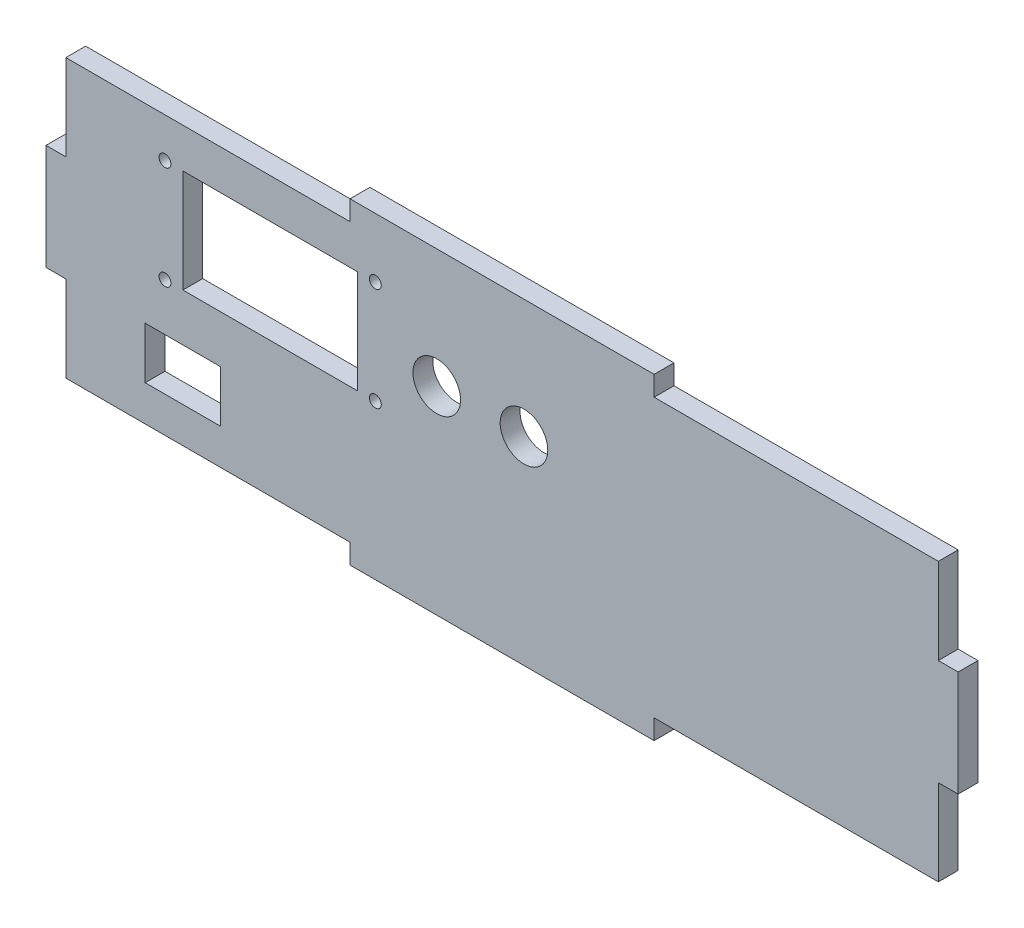
ISO-10303-21;
HEADER;
FILE_DESCRIPTION(('STEP AP214'),'2;1');
FILE_NAME('part.step','',(''),(''),'','','');
FILE_SCHEMA(('AUTOMOTIVE_DESIGN { 1 0 10303 214 1 1 1 1 }'));
ENDSEC;
DATA;
#1=APPLICATION_CONTEXT('core data for automotive mechanical design processes');
#2=APPLICATION_PROTOCOL_DEFINITION('international standard','automotive_design',2000,#1);
#3=PRODUCT_CONTEXT('',#1,'mechanical');
#4=PRODUCT('Part','Part','',(#3));
#5=PRODUCT_RELATED_PRODUCT_CATEGORY('part','',(#4));
#6=PRODUCT_DEFINITION_FORMATION('','',#4);
#7=PRODUCT_DEFINITION_CONTEXT('part definition',#1,'design');
#8=PRODUCT_DEFINITION('design','',#6,#7);
#9=PRODUCT_DEFINITION_SHAPE('','',#8);
#10=(LENGTH_UNIT() NAMED_UNIT(*) SI_UNIT(.MILLI.,.METRE.));
#11=(NAMED_UNIT(*) PLANE_ANGLE_UNIT() SI_UNIT($,.RADIAN.));
#12=(NAMED_UNIT(*) SI_UNIT($,.STERADIAN.) SOLID_ANGLE_UNIT());
#13=UNCERTAINTY_MEASURE_WITH_UNIT(LENGTH_MEASURE(1.E-05),#10,'distance_accuracy_value','');
#14=(GEOMETRIC_REPRESENTATION_CONTEXT(3) GLOBAL_UNCERTAINTY_ASSIGNED_CONTEXT((#13)) GLOBAL_UNIT_ASSIGNED_CONTEXT((#10,
#11,#12)) REPRESENTATION_CONTEXT('',''));
#15=CARTESIAN_POINT('',(0.,0.,0.));
#16=DIRECTION('',(0.,0.,1.));
#17=DIRECTION('',(1.,0.,0.));
#18=AXIS2_PLACEMENT_3D('',#15,#16,#17);
#19=CARTESIAN_POINT('',(0.,5.,5.));
#20=DIRECTION('',(0.,1.,0.));
#21=DIRECTION('',(0.,0.,1.));
#22=AXIS2_PLACEMENT_3D('',#19,#20,#21);
#23=PLANE('',#22);
#24=DIRECTION('',(1.,0.,0.));
#25=VECTOR('',#24,1.);
#26=CARTESIAN_POINT('',(0.,5.,0.));
#27=LINE('',#26,#25);
#28=CARTESIAN_POINT('',(5.,5.,0.));
#29=VERTEX_POINT('',#28);
#30=CARTESIAN_POINT('',(76.6666666666667,5.,0.));
#31=VERTEX_POINT('',#30);
#32=EDGE_CURVE('E342',#29,#31,#27,.T.);
#33=ORIENTED_EDGE('',*,*,#32,.T.);
#34=DIRECTION('',(0.,0.,-1.));
#35=VECTOR('',#34,1.);
#36=CARTESIAN_POINT('',(76.6666666666667,5.,5.));
#37=LINE('',#36,#35);
#38=CARTESIAN_POINT('',(76.6666666666667,5.,5.));
#39=VERTEX_POINT('',#38);
#40=EDGE_CURVE('E433',#39,#31,#37,.T.);
#41=ORIENTED_EDGE('',*,*,#40,.F.);
#42=DIRECTION('',(1.,0.,0.));
#43=VECTOR('',#42,1.);
#44=CARTESIAN_POINT('',(0.,5.,5.));
#45=LINE('',#44,#43);
#46=CARTESIAN_POINT('',(5.,5.,5.));
#47=VERTEX_POINT('',#46);
#48=EDGE_CURVE('E275',#47,#39,#45,.T.);
#49=ORIENTED_EDGE('',*,*,#48,.F.);
#50=DIRECTION('',(0.,0.,-1.));
#51=VECTOR('',#50,1.);
#52=CARTESIAN_POINT('',(5.,5.,5.));
#53=LINE('',#52,#51);
#54=EDGE_CURVE('E389',#47,#29,#53,.T.);
#55=ORIENTED_EDGE('',*,*,#54,.T.);
#56=EDGE_LOOP('',(#33,#41,#49,#55));
#57=FACE_BOUND('',#56,.T.);
#58=ADVANCED_FACE('F35',(#57),#23,.F.);
#59=CARTESIAN_POINT('',(76.6666666666667,0.,5.));
#60=DIRECTION('',(-1.,0.,0.));
#61=DIRECTION('',(0.,0.,1.));
#62=AXIS2_PLACEMENT_3D('',#59,#60,#61);
#63=PLANE('',#62);
#64=DIRECTION('',(0.,1.,0.));
#65=VECTOR('',#64,1.);
#66=CARTESIAN_POINT('',(76.6666666666667,0.,0.));
#67=LINE('',#66,#65);
#68=CARTESIAN_POINT('',(76.6666666666667,0.,0.));
#69=VERTEX_POINT('',#68);
#70=EDGE_CURVE('E345',#69,#31,#67,.T.);
#71=ORIENTED_EDGE('',*,*,#70,.F.);
#72=DIRECTION('',(0.,0.,-1.));
#73=VECTOR('',#72,1.);
#74=CARTESIAN_POINT('',(76.6666666666667,0.,5.));
#75=LINE('',#74,#73);
#76=CARTESIAN_POINT('',(76.6666666666667,0.,5.));
#77=VERTEX_POINT('',#76);
#78=EDGE_CURVE('E431',#77,#69,#75,.T.);
#79=ORIENTED_EDGE('',*,*,#78,.F.);
#80=DIRECTION('',(0.,1.,0.));
#81=VECTOR('',#80,1.);
#82=CARTESIAN_POINT('',(76.6666666666667,0.,5.));
#83=LINE('',#82,#81);
#84=EDGE_CURVE('E277',#77,#39,#83,.T.);
#85=ORIENTED_EDGE('',*,*,#84,.T.);
#86=ORIENTED_EDGE('',*,*,#40,.T.);
#87=EDGE_LOOP('',(#71,#79,#85,#86));
#88=FACE_BOUND('',#87,.T.);
#89=ADVANCED_FACE('F483',(#88),#63,.T.);
#90=CARTESIAN_POINT('',(0.,0.,5.));
#91=DIRECTION('',(0.,1.,0.));
#92=DIRECTION('',(0.,0.,1.));
#93=AXIS2_PLACEMENT_3D('',#90,#91,#92);
#94=PLANE('',#93);
#95=DIRECTION('',(1.,0.,0.));
#96=VECTOR('',#95,1.);
#97=CARTESIAN_POINT('',(0.,0.,0.));
#98=LINE('',#97,#96);
#99=CARTESIAN_POINT('',(153.333333333333,0.,0.));
#100=VERTEX_POINT('',#99);
#101=EDGE_CURVE('E349',#69,#100,#98,.T.);
#102=ORIENTED_EDGE('',*,*,#101,.T.);
#103=DIRECTION('',(0.,0.,-1.));
#104=VECTOR('',#103,1.);
#105=CARTESIAN_POINT('',(153.333333333333,0.,5.));
#106=LINE('',#105,#104);
#107=CARTESIAN_POINT('',(153.333333333333,0.,5.));
#108=VERTEX_POINT('',#107);
#109=EDGE_CURVE('E428',#108,#100,#106,.T.);
#110=ORIENTED_EDGE('',*,*,#109,.F.);
#111=DIRECTION('',(1.,0.,0.));
#112=VECTOR('',#111,1.);
#113=CARTESIAN_POINT('',(0.,0.,5.));
#114=LINE('',#113,#112);
#115=EDGE_CURVE('E281',#77,#108,#114,.T.);
#116=ORIENTED_EDGE('',*,*,#115,.F.);
#117=ORIENTED_EDGE('',*,*,#78,.T.);
#118=EDGE_LOOP('',(#102,#110,#116,#117));
#119=FACE_BOUND('',#118,.T.);
#120=ADVANCED_FACE('F490',(#119),#94,.F.);
#121=CARTESIAN_POINT('',(153.333333333333,0.,5.));
#122=DIRECTION('',(-1.,0.,0.));
#123=DIRECTION('',(0.,0.,1.));
#124=AXIS2_PLACEMENT_3D('',#121,#122,#123);
#125=PLANE('',#124);
#126=DIRECTION('',(0.,1.,0.));
#127=VECTOR('',#126,1.);
#128=CARTESIAN_POINT('',(153.333333333333,0.,0.));
#129=LINE('',#128,#127);
#130=CARTESIAN_POINT('',(153.333333333333,5.,0.));
#131=VERTEX_POINT('',#130);
#132=EDGE_CURVE('E351',#100,#131,#129,.T.);
#133=ORIENTED_EDGE('',*,*,#132,.T.);
#134=DIRECTION('',(0.,0.,-1.));
#135=VECTOR('',#134,1.);
#136=CARTESIAN_POINT('',(153.333333333333,5.,5.));
#137=LINE('',#136,#135);
#138=CARTESIAN_POINT('',(153.333333333333,5.,5.));
#139=VERTEX_POINT('',#138);
#140=EDGE_CURVE('E425',#139,#131,#137,.T.);
#141=ORIENTED_EDGE('',*,*,#140,.F.);
#142=DIRECTION('',(0.,1.,0.));
#143=VECTOR('',#142,1.);
#144=CARTESIAN_POINT('',(153.333333333333,0.,5.));
#145=LINE('',#144,#143);
#146=EDGE_CURVE('E283',#108,#139,#145,.T.);
#147=ORIENTED_EDGE('',*,*,#146,.F.);
#148=ORIENTED_EDGE('',*,*,#109,.T.);
#149=EDGE_LOOP('',(#133,#141,#147,#148));
#150=FACE_BOUND('',#149,.T.);
#151=ADVANCED_FACE('F497',(#150),#125,.F.);
#152=CARTESIAN_POINT('',(225.,5.,0.));
#153=VERTEX_POINT('',#152);
#154=EDGE_CURVE('E346',#131,#153,#27,.T.);
#155=ORIENTED_EDGE('',*,*,#154,.T.);
#156=DIRECTION('',(0.,0.,-1.));
#157=VECTOR('',#156,1.);
#158=CARTESIAN_POINT('',(225.,5.,5.));
#159=LINE('',#158,#157);
#160=CARTESIAN_POINT('',(225.,5.,5.));
#161=VERTEX_POINT('',#160);
#162=EDGE_CURVE('E422',#161,#153,#159,.T.);
#163=ORIENTED_EDGE('',*,*,#162,.F.);
#164=EDGE_CURVE('E278',#139,#161,#45,.T.);
#165=ORIENTED_EDGE('',*,*,#164,.F.);
#166=ORIENTED_EDGE('',*,*,#140,.T.);
#167=EDGE_LOOP('',(#155,#163,#165,#166));
#168=FACE_BOUND('',#167,.T.);
#169=ADVANCED_FACE('F486',(#168),#23,.F.);
#170=CARTESIAN_POINT('',(225.,0.,5.));
#171=DIRECTION('',(-1.,0.,0.));
#172=DIRECTION('',(0.,0.,1.));
#173=AXIS2_PLACEMENT_3D('',#170,#171,#172);
#174=PLANE('',#173);
#175=DIRECTION('',(0.,1.,0.));
#176=VECTOR('',#175,1.);
#177=CARTESIAN_POINT('',(225.,0.,0.));
#178=LINE('',#177,#176);
#179=CARTESIAN_POINT('',(225.,26.6666666666667,0.));
#180=VERTEX_POINT('',#179);
#181=EDGE_CURVE('E353',#153,#180,#178,.T.);
#182=ORIENTED_EDGE('',*,*,#181,.T.);
#183=DIRECTION('',(0.,0.,-1.));
#184=VECTOR('',#183,1.);
#185=CARTESIAN_POINT('',(225.,26.6666666666667,5.));
#186=LINE('',#185,#184);
#187=CARTESIAN_POINT('',(225.,26.6666666666667,5.));
#188=VERTEX_POINT('',#187);
#189=EDGE_CURVE('E420',#188,#180,#186,.T.);
#190=ORIENTED_EDGE('',*,*,#189,.F.);
#191=DIRECTION('',(0.,1.,0.));
#192=VECTOR('',#191,1.);
#193=CARTESIAN_POINT('',(225.,0.,5.));
#194=LINE('',#193,#192);
#195=EDGE_CURVE('E285',#161,#188,#194,.T.);
#196=ORIENTED_EDGE('',*,*,#195,.F.);
#197=ORIENTED_EDGE('',*,*,#162,.T.);
#198=EDGE_LOOP('',(#182,#190,#196,#197));
#199=FACE_BOUND('',#198,.T.);
#200=ADVANCED_FACE('F496',(#199),#174,.F.);
#201=CARTESIAN_POINT('',(0.,26.6666666666667,5.));
#202=DIRECTION('',(0.,-1.,0.));
#203=DIRECTION('',(0.,0.,-1.));
#204=AXIS2_PLACEMENT_3D('',#201,#202,#203);
#205=PLANE('',#204);
#206=DIRECTION('',(-1.,0.,0.));
#207=VECTOR('',#206,1.);
#208=CARTESIAN_POINT('',(0.,26.6666666666667,0.));
#209=LINE('',#208,#207);
#210=CARTESIAN_POINT('',(230.,26.6666666666667,0.));
#211=VERTEX_POINT('',#210);
#212=EDGE_CURVE('E356',#211,#180,#209,.T.);
#213=ORIENTED_EDGE('',*,*,#212,.F.);
#214=DIRECTION('',(0.,0.,-1.));
#215=VECTOR('',#214,1.);
#216=CARTESIAN_POINT('',(230.,26.6666666666667,5.));
#217=LINE('',#216,#215);
#218=CARTESIAN_POINT('',(230.,26.6666666666667,5.));
#219=VERTEX_POINT('',#218);
#220=EDGE_CURVE('E418',#219,#211,#217,.T.);
#221=ORIENTED_EDGE('',*,*,#220,.F.);
#222=DIRECTION('',(-1.,0.,0.));
#223=VECTOR('',#222,1.);
#224=CARTESIAN_POINT('',(0.,26.6666666666667,5.));
#225=LINE('',#224,#223);
#226=EDGE_CURVE('E287',#219,#188,#225,.T.);
#227=ORIENTED_EDGE('',*,*,#226,.T.);
#228=ORIENTED_EDGE('',*,*,#189,.T.);
#229=EDGE_LOOP('',(#213,#221,#227,#228));
#230=FACE_BOUND('',#229,.T.);
#231=ADVANCED_FACE('F503',(#230),#205,.T.);
#232=CARTESIAN_POINT('',(230.,0.,5.));
#233=DIRECTION('',(-1.,0.,0.));
#234=DIRECTION('',(0.,0.,1.));
#235=AXIS2_PLACEMENT_3D('',#232,#233,#234);
#236=PLANE('',#235);
#237=DIRECTION('',(0.,1.,0.));
#238=VECTOR('',#237,1.);
#239=CARTESIAN_POINT('',(230.,0.,0.));
#240=LINE('',#239,#238);
#241=CARTESIAN_POINT('',(230.,53.3333333333333,0.));
#242=VERTEX_POINT('',#241);
#243=EDGE_CURVE('E360',#211,#242,#240,.T.);
#244=ORIENTED_EDGE('',*,*,#243,.T.);
#245=DIRECTION('',(0.,0.,-1.));
#246=VECTOR('',#245,1.);
#247=CARTESIAN_POINT('',(230.,53.3333333333333,5.));
#248=LINE('',#247,#246);
#249=CARTESIAN_POINT('',(230.,53.3333333333333,5.));
#250=VERTEX_POINT('',#249);
#251=EDGE_CURVE('E415',#250,#242,#248,.T.);
#252=ORIENTED_EDGE('',*,*,#251,.F.);
#253=DIRECTION('',(0.,1.,0.));
#254=VECTOR('',#253,1.);
#255=CARTESIAN_POINT('',(230.,0.,5.));
#256=LINE('',#255,#254);
#257=EDGE_CURVE('E291',#219,#250,#256,.T.);
#258=ORIENTED_EDGE('',*,*,#257,.F.);
#259=ORIENTED_EDGE('',*,*,#220,.T.);
#260=EDGE_LOOP('',(#244,#252,#258,#259));
#261=FACE_BOUND('',#260,.T.);
#262=ADVANCED_FACE('F588',(#261),#236,.F.);
#263=CARTESIAN_POINT('',(0.,53.3333333333333,5.));
#264=DIRECTION('',(0.,-1.,0.));
#265=DIRECTION('',(0.,0.,-1.));
#266=AXIS2_PLACEMENT_3D('',#263,#264,#265);
#267=PLANE('',#266);
#268=DIRECTION('',(-1.,0.,0.));
#269=VECTOR('',#268,1.);
#270=CARTESIAN_POINT('',(0.,53.3333333333333,0.));
#271=LINE('',#270,#269);
#272=CARTESIAN_POINT('',(225.,53.3333333333333,0.));
#273=VERTEX_POINT('',#272);
#274=EDGE_CURVE('E362',#242,#273,#271,.T.);
#275=ORIENTED_EDGE('',*,*,#274,.T.);
#276=DIRECTION('',(0.,0.,-1.));
#277=VECTOR('',#276,1.);
#278=CARTESIAN_POINT('',(225.,53.3333333333333,5.));
#279=LINE('',#278,#277);
#280=CARTESIAN_POINT('',(225.,53.3333333333333,5.));
#281=VERTEX_POINT('',#280);
#282=EDGE_CURVE('E412',#281,#273,#279,.T.);
#283=ORIENTED_EDGE('',*,*,#282,.F.);
#284=DIRECTION('',(-1.,0.,0.));
#285=VECTOR('',#284,1.);
#286=CARTESIAN_POINT('',(0.,53.3333333333333,5.));
#287=LINE('',#286,#285);
#288=EDGE_CURVE('E293',#250,#281,#287,.T.);
#289=ORIENTED_EDGE('',*,*,#288,.F.);
#290=ORIENTED_EDGE('',*,*,#251,.T.);
#291=EDGE_LOOP('',(#275,#283,#289,#290));
#292=FACE_BOUND('',#291,.T.);
#293=ADVANCED_FACE('F586',(#292),#267,.F.);
#294=CARTESIAN_POINT('',(225.,75.,0.));
#295=VERTEX_POINT('',#294);
#296=EDGE_CURVE('E357',#273,#295,#178,.T.);
#297=ORIENTED_EDGE('',*,*,#296,.T.);
#298=DIRECTION('',(0.,0.,-1.));
#299=VECTOR('',#298,1.);
#300=CARTESIAN_POINT('',(225.,75.,5.));
#301=LINE('',#300,#299);
#302=CARTESIAN_POINT('',(225.,75.,5.));
#303=VERTEX_POINT('',#302);
#304=EDGE_CURVE('E410',#303,#295,#301,.T.);
#305=ORIENTED_EDGE('',*,*,#304,.F.);
#306=EDGE_CURVE('E288',#281,#303,#194,.T.);
#307=ORIENTED_EDGE('',*,*,#306,.F.);
#308=ORIENTED_EDGE('',*,*,#282,.T.);
#309=EDGE_LOOP('',(#297,#305,#307,#308));
#310=FACE_BOUND('',#309,.T.);
#311=ADVANCED_FACE('F506',(#310),#174,.F.);
#312=CARTESIAN_POINT('',(0.,75.,5.));
#313=DIRECTION('',(0.,1.,0.));
#314=DIRECTION('',(0.,0.,1.));
#315=AXIS2_PLACEMENT_3D('',#312,#313,#314);
#316=PLANE('',#315);
#317=DIRECTION('',(1.,0.,0.));
#318=VECTOR('',#317,1.);
#319=CARTESIAN_POINT('',(0.,75.,0.));
#320=LINE('',#319,#318);
#321=CARTESIAN_POINT('',(153.333333333333,75.,0.));
#322=VERTEX_POINT('',#321);
#323=EDGE_CURVE('E364',#322,#295,#320,.T.);
#324=ORIENTED_EDGE('',*,*,#323,.F.);
#325=DIRECTION('',(0.,0.,-1.));
#326=VECTOR('',#325,1.);
#327=CARTESIAN_POINT('',(153.333333333333,75.,5.));
#328=LINE('',#327,#326);
#329=CARTESIAN_POINT('',(153.333333333333,75.,5.));
#330=VERTEX_POINT('',#329);
#331=EDGE_CURVE('E408',#330,#322,#328,.T.);
#332=ORIENTED_EDGE('',*,*,#331,.F.);
#333=DIRECTION('',(1.,0.,0.));
#334=VECTOR('',#333,1.);
#335=CARTESIAN_POINT('',(0.,75.,5.));
#336=LINE('',#335,#334);
#337=EDGE_CURVE('E295',#330,#303,#336,.T.);
#338=ORIENTED_EDGE('',*,*,#337,.T.);
#339=ORIENTED_EDGE('',*,*,#304,.T.);
#340=EDGE_LOOP('',(#324,#332,#338,#339));
#341=FACE_BOUND('',#340,.T.);
#342=ADVANCED_FACE('F578',(#341),#316,.T.);
#343=CARTESIAN_POINT('',(153.333333333333,0.,5.));
#344=DIRECTION('',(1.,0.,0.));
#345=DIRECTION('',(0.,0.,-1.));
#346=AXIS2_PLACEMENT_3D('',#343,#344,#345);
#347=PLANE('',#346);
#348=DIRECTION('',(0.,-1.,0.));
#349=VECTOR('',#348,1.);
#350=CARTESIAN_POINT('',(153.333333333333,0.,0.));
#351=LINE('',#350,#349);
#352=CARTESIAN_POINT('',(153.333333333333,80.,0.));
#353=VERTEX_POINT('',#352);
#354=EDGE_CURVE('E367',#353,#322,#351,.T.);
#355=ORIENTED_EDGE('',*,*,#354,.F.);
#356=DIRECTION('',(0.,0.,-1.));
#357=VECTOR('',#356,1.);
#358=CARTESIAN_POINT('',(153.333333333333,80.,5.));
#359=LINE('',#358,#357);
#360=CARTESIAN_POINT('',(153.333333333333,80.,5.));
#361=VERTEX_POINT('',#360);
#362=EDGE_CURVE('E406',#361,#353,#359,.T.);
#363=ORIENTED_EDGE('',*,*,#362,.F.);
#364=DIRECTION('',(0.,-1.,0.));
#365=VECTOR('',#364,1.);
#366=CARTESIAN_POINT('',(153.333333333333,0.,5.));
#367=LINE('',#366,#365);
#368=EDGE_CURVE('E298',#361,#330,#367,.T.);
#369=ORIENTED_EDGE('',*,*,#368,.T.);
#370=ORIENTED_EDGE('',*,*,#331,.T.);
#371=EDGE_LOOP('',(#355,#363,#369,#370));
#372=FACE_BOUND('',#371,.T.);
#373=ADVANCED_FACE('F573',(#372),#347,.T.);
#374=CARTESIAN_POINT('',(0.,80.,5.));
#375=DIRECTION('',(0.,1.,0.));
#376=DIRECTION('',(0.,0.,1.));
#377=AXIS2_PLACEMENT_3D('',#374,#375,#376);
#378=PLANE('',#377);
#379=DIRECTION('',(1.,0.,0.));
#380=VECTOR('',#379,1.);
#381=CARTESIAN_POINT('',(0.,80.,0.));
#382=LINE('',#381,#380);
#383=CARTESIAN_POINT('',(76.6666666666667,80.,0.));
#384=VERTEX_POINT('',#383);
#385=EDGE_CURVE('E371',#384,#353,#382,.T.);
#386=ORIENTED_EDGE('',*,*,#385,.F.);
#387=DIRECTION('',(0.,0.,-1.));
#388=VECTOR('',#387,1.);
#389=CARTESIAN_POINT('',(76.6666666666667,80.,5.));
#390=LINE('',#389,#388);
#391=CARTESIAN_POINT('',(76.6666666666667,80.,5.));
#392=VERTEX_POINT('',#391);
#393=EDGE_CURVE('E404',#392,#384,#390,.T.);
#394=ORIENTED_EDGE('',*,*,#393,.F.);
#395=DIRECTION('',(1.,0.,0.));
#396=VECTOR('',#395,1.);
#397=CARTESIAN_POINT('',(0.,80.,5.));
#398=LINE('',#397,#396);
#399=EDGE_CURVE('E302',#392,#361,#398,.T.);
#400=ORIENTED_EDGE('',*,*,#399,.T.);
#401=ORIENTED_EDGE('',*,*,#362,.T.);
#402=EDGE_LOOP('',(#386,#394,#400,#401));
#403=FACE_BOUND('',#402,.T.);
#404=ADVANCED_FACE('F568',(#403),#378,.T.);
#405=CARTESIAN_POINT('',(76.6666666666667,0.,5.));
#406=DIRECTION('',(1.,0.,0.));
#407=DIRECTION('',(0.,0.,-1.));
#408=AXIS2_PLACEMENT_3D('',#405,#406,#407);
#409=PLANE('',#408);
#410=DIRECTION('',(0.,-1.,0.));
#411=VECTOR('',#410,1.);
#412=CARTESIAN_POINT('',(76.6666666666667,0.,0.));
#413=LINE('',#412,#411);
#414=CARTESIAN_POINT('',(76.6666666666667,75.,0.));
#415=VERTEX_POINT('',#414);
#416=EDGE_CURVE('E374',#384,#415,#413,.T.);
#417=ORIENTED_EDGE('',*,*,#416,.T.);
#418=DIRECTION('',(0.,0.,-1.));
#419=VECTOR('',#418,1.);
#420=CARTESIAN_POINT('',(76.6666666666667,75.,5.));
#421=LINE('',#420,#419);
#422=CARTESIAN_POINT('',(76.6666666666667,75.,5.));
#423=VERTEX_POINT('',#422);
#424=EDGE_CURVE('E402',#423,#415,#421,.T.);
#425=ORIENTED_EDGE('',*,*,#424,.F.);
#426=DIRECTION('',(0.,-1.,0.));
#427=VECTOR('',#426,1.);
#428=CARTESIAN_POINT('',(76.6666666666667,0.,5.));
#429=LINE('',#428,#427);
#430=EDGE_CURVE('E305',#392,#423,#429,.T.);
#431=ORIENTED_EDGE('',*,*,#430,.F.);
#432=ORIENTED_EDGE('',*,*,#393,.T.);
#433=EDGE_LOOP('',(#417,#425,#431,#432));
#434=FACE_BOUND('',#433,.T.);
#435=ADVANCED_FACE('F565',(#434),#409,.F.);
#436=CARTESIAN_POINT('',(5.,75.,0.));
#437=VERTEX_POINT('',#436);
#438=EDGE_CURVE('E368',#437,#415,#320,.T.);
#439=ORIENTED_EDGE('',*,*,#438,.F.);
#440=DIRECTION('',(0.,0.,-1.));
#441=VECTOR('',#440,1.);
#442=CARTESIAN_POINT('',(5.,75.,5.));
#443=LINE('',#442,#441);
#444=CARTESIAN_POINT('',(5.,75.,5.));
#445=VERTEX_POINT('',#444);
#446=EDGE_CURVE('E400',#445,#437,#443,.T.);
#447=ORIENTED_EDGE('',*,*,#446,.F.);
#448=EDGE_CURVE('E299',#445,#423,#336,.T.);
#449=ORIENTED_EDGE('',*,*,#448,.T.);
#450=ORIENTED_EDGE('',*,*,#424,.T.);
#451=EDGE_LOOP('',(#439,#447,#449,#450));
#452=FACE_BOUND('',#451,.T.);
#453=ADVANCED_FACE('F561',(#452),#316,.T.);
#454=CARTESIAN_POINT('',(5.,0.,5.));
#455=DIRECTION('',(-1.,0.,0.));
#456=DIRECTION('',(0.,-1.,0.));
#457=AXIS2_PLACEMENT_3D('',#454,#455,#456);
#458=PLANE('',#457);
#459=DIRECTION('',(0.,1.,0.));
#460=VECTOR('',#459,1.);
#461=CARTESIAN_POINT('',(5.,0.,0.));
#462=LINE('',#461,#460);
#463=CARTESIAN_POINT('',(5.,53.3333333333333,0.));
#464=VERTEX_POINT('',#463);
#465=EDGE_CURVE('E377',#464,#437,#462,.T.);
#466=ORIENTED_EDGE('',*,*,#465,.F.);
#467=DIRECTION('',(0.,0.,-1.));
#468=VECTOR('',#467,1.);
#469=CARTESIAN_POINT('',(5.,53.3333333333333,5.));
#470=LINE('',#469,#468);
#471=CARTESIAN_POINT('',(5.,53.3333333333333,5.));
#472=VERTEX_POINT('',#471);
#473=EDGE_CURVE('E398',#472,#464,#470,.T.);
#474=ORIENTED_EDGE('',*,*,#473,.F.);
#475=DIRECTION('',(0.,1.,0.));
#476=VECTOR('',#475,1.);
#477=CARTESIAN_POINT('',(5.,0.,5.));
#478=LINE('',#477,#476);
#479=EDGE_CURVE('E307',#472,#445,#478,.T.);
#480=ORIENTED_EDGE('',*,*,#479,.T.);
#481=ORIENTED_EDGE('',*,*,#446,.T.);
#482=EDGE_LOOP('',(#466,#474,#480,#481));
#483=FACE_BOUND('',#482,.T.);
#484=ADVANCED_FACE('F480',(#483),#458,.T.);
#485=CARTESIAN_POINT('',(0.,53.3333333333333,5.));
#486=DIRECTION('',(0.,1.,0.));
#487=DIRECTION('',(0.,0.,1.));
#488=AXIS2_PLACEMENT_3D('',#485,#486,#487);
#489=PLANE('',#488);
#490=DIRECTION('',(1.,0.,0.));
#491=VECTOR('',#490,1.);
#492=CARTESIAN_POINT('',(0.,53.3333333333333,0.));
#493=LINE('',#492,#491);
#494=CARTESIAN_POINT('',(0.,53.3333333333333,0.));
#495=VERTEX_POINT('',#494);
#496=EDGE_CURVE('E380',#495,#464,#493,.T.);
#497=ORIENTED_EDGE('',*,*,#496,.F.);
#498=DIRECTION('',(0.,0.,-1.));
#499=VECTOR('',#498,1.);
#500=CARTESIAN_POINT('',(0.,53.3333333333333,5.));
#501=LINE('',#500,#499);
#502=CARTESIAN_POINT('',(0.,53.3333333333333,5.));
#503=VERTEX_POINT('',#502);
#504=EDGE_CURVE('E396',#503,#495,#501,.T.);
#505=ORIENTED_EDGE('',*,*,#504,.F.);
#506=DIRECTION('',(1.,0.,0.));
#507=VECTOR('',#506,1.);
#508=CARTESIAN_POINT('',(0.,53.3333333333333,5.));
#509=LINE('',#508,#507);
#510=EDGE_CURVE('E310',#503,#472,#509,.T.);
#511=ORIENTED_EDGE('',*,*,#510,.T.);
#512=ORIENTED_EDGE('',*,*,#473,.T.);
#513=EDGE_LOOP('',(#497,#505,#511,#512));
#514=FACE_BOUND('',#513,.T.);
#515=ADVANCED_FACE('F551',(#514),#489,.T.);
#516=CARTESIAN_POINT('',(0.,0.,5.));
#517=DIRECTION('',(-1.,0.,0.));
#518=DIRECTION('',(0.,0.,1.));
#519=AXIS2_PLACEMENT_3D('',#516,#517,#518);
#520=PLANE('',#519);
#521=DIRECTION('',(0.,1.,0.));
#522=VECTOR('',#521,1.);
#523=CARTESIAN_POINT('',(0.,0.,0.));
#524=LINE('',#523,#522);
#525=CARTESIAN_POINT('',(0.,26.6666666666667,0.));
#526=VERTEX_POINT('',#525);
#527=EDGE_CURVE('E383',#526,#495,#524,.T.);
#528=ORIENTED_EDGE('',*,*,#527,.F.);
#529=DIRECTION('',(0.,0.,-1.));
#530=VECTOR('',#529,1.);
#531=CARTESIAN_POINT('',(0.,26.6666666666667,5.));
#532=LINE('',#531,#530);
#533=CARTESIAN_POINT('',(0.,26.6666666666667,5.));
#534=VERTEX_POINT('',#533);
#535=EDGE_CURVE('E394',#534,#526,#532,.T.);
#536=ORIENTED_EDGE('',*,*,#535,.F.);
#537=DIRECTION('',(0.,1.,0.));
#538=VECTOR('',#537,1.);
#539=CARTESIAN_POINT('',(0.,0.,5.));
#540=LINE('',#539,#538);
#541=EDGE_CURVE('E314',#534,#503,#540,.T.);
#542=ORIENTED_EDGE('',*,*,#541,.T.);
#543=ORIENTED_EDGE('',*,*,#504,.T.);
#544=EDGE_LOOP('',(#528,#536,#542,#543));
#545=FACE_BOUND('',#544,.T.);
#546=ADVANCED_FACE('F546',(#545),#520,.T.);
#547=CARTESIAN_POINT('',(0.,26.6666666666667,5.));
#548=DIRECTION('',(0.,1.,0.));
#549=DIRECTION('',(0.,0.,1.));
#550=AXIS2_PLACEMENT_3D('',#547,#548,#549);
#551=PLANE('',#550);
#552=DIRECTION('',(1.,0.,0.));
#553=VECTOR('',#552,1.);
#554=CARTESIAN_POINT('',(0.,26.6666666666667,0.));
#555=LINE('',#554,#553);
#556=CARTESIAN_POINT('',(5.,26.6666666666667,0.));
#557=VERTEX_POINT('',#556);
#558=EDGE_CURVE('E386',#526,#557,#555,.T.);
#559=ORIENTED_EDGE('',*,*,#558,.T.);
#560=DIRECTION('',(0.,0.,-1.));
#561=VECTOR('',#560,1.);
#562=CARTESIAN_POINT('',(5.,26.6666666666667,5.));
#563=LINE('',#562,#561);
#564=CARTESIAN_POINT('',(5.,26.6666666666667,5.));
#565=VERTEX_POINT('',#564);
#566=EDGE_CURVE('E391',#565,#557,#563,.T.);
#567=ORIENTED_EDGE('',*,*,#566,.F.);
#568=DIRECTION('',(1.,0.,0.));
#569=VECTOR('',#568,1.);
#570=CARTESIAN_POINT('',(0.,26.6666666666667,5.));
#571=LINE('',#570,#569);
#572=EDGE_CURVE('E317',#534,#565,#571,.T.);
#573=ORIENTED_EDGE('',*,*,#572,.F.);
#574=ORIENTED_EDGE('',*,*,#535,.T.);
#575=EDGE_LOOP('',(#559,#567,#573,#574));
#576=FACE_BOUND('',#575,.T.);
#577=ADVANCED_FACE('F543',(#576),#551,.F.);
#578=CARTESIAN_POINT('',(0.,65.,5.));
#579=DIRECTION('',(0.,1.,0.));
#580=DIRECTION('',(0.,0.,1.));
#581=AXIS2_PLACEMENT_3D('',#578,#579,#580);
#582=PLANE('',#581);
#583=DIRECTION('',(1.,0.,0.));
#584=VECTOR('',#583,1.);
#585=CARTESIAN_POINT('',(0.,65.,0.));
#586=LINE('',#585,#584);
#587=CARTESIAN_POINT('',(34.52,65.,0.));
#588=VERTEX_POINT('',#587);
#589=CARTESIAN_POINT('',(78.52,65.,0.));
#590=VERTEX_POINT('',#589);
#591=EDGE_CURVE('E330',#588,#590,#586,.T.);
#592=ORIENTED_EDGE('',*,*,#591,.T.);
#593=DIRECTION('',(0.,0.,-1.));
#594=VECTOR('',#593,1.);
#595=CARTESIAN_POINT('',(78.52,65.,5.));
#596=LINE('',#595,#594);
#597=CARTESIAN_POINT('',(78.52,65.,5.));
#598=VERTEX_POINT('',#597);
#599=EDGE_CURVE('E392',#598,#590,#596,.T.);
#600=ORIENTED_EDGE('',*,*,#599,.F.);
#601=DIRECTION('',(1.,0.,0.));
#602=VECTOR('',#601,1.);
#603=CARTESIAN_POINT('',(0.,65.,5.));
#604=LINE('',#603,#602);
#605=CARTESIAN_POINT('',(34.52,65.,5.));
#606=VERTEX_POINT('',#605);
#607=EDGE_CURVE('E264',#606,#598,#604,.T.);
#608=ORIENTED_EDGE('',*,*,#607,.F.);
#609=DIRECTION('',(0.,0.,-1.));
#610=VECTOR('',#609,1.);
#611=CARTESIAN_POINT('',(34.52,65.,5.));
#612=LINE('',#611,#610);
#613=EDGE_CURVE('E436',#606,#588,#612,.T.);
#614=ORIENTED_EDGE('',*,*,#613,.T.);
#615=EDGE_LOOP('',(#592,#600,#608,#614));
#616=FACE_BOUND('',#615,.T.);
#617=ADVANCED_FACE('F611',(#616),#582,.F.);
#618=CARTESIAN_POINT('',(78.52,0.,5.));
#619=DIRECTION('',(1.,0.,0.));
#620=DIRECTION('',(0.,0.,-1.));
#621=AXIS2_PLACEMENT_3D('',#618,#619,#620);
#622=PLANE('',#621);
#623=DIRECTION('',(0.,-1.,0.));
#624=VECTOR('',#623,1.);
#625=CARTESIAN_POINT('',(78.52,0.,0.));
#626=LINE('',#625,#624);
#627=CARTESIAN_POINT('',(78.52,39.,0.));
#628=VERTEX_POINT('',#627);
#629=EDGE_CURVE('E333',#590,#628,#626,.T.);
#630=ORIENTED_EDGE('',*,*,#629,.T.);
#631=DIRECTION('',(0.,0.,-1.));
#632=VECTOR('',#631,1.);
#633=CARTESIAN_POINT('',(78.52,39.,5.));
#634=LINE('',#633,#632);
#635=CARTESIAN_POINT('',(78.52,39.,5.));
#636=VERTEX_POINT('',#635);
#637=EDGE_CURVE('E440',#636,#628,#634,.T.);
#638=ORIENTED_EDGE('',*,*,#637,.F.);
#639=DIRECTION('',(0.,-1.,0.));
#640=VECTOR('',#639,1.);
#641=CARTESIAN_POINT('',(78.52,0.,5.));
#642=LINE('',#641,#640);
#643=EDGE_CURVE('E267',#598,#636,#642,.T.);
#644=ORIENTED_EDGE('',*,*,#643,.F.);
#645=ORIENTED_EDGE('',*,*,#599,.T.);
#646=EDGE_LOOP('',(#630,#638,#644,#645));
#647=FACE_BOUND('',#646,.T.);
#648=ADVANCED_FACE('F615',(#647),#622,.F.);
#649=CARTESIAN_POINT('',(0.,39.,5.));
#650=DIRECTION('',(0.,1.,0.));
#651=DIRECTION('',(0.,0.,1.));
#652=AXIS2_PLACEMENT_3D('',#649,#650,#651);
#653=PLANE('',#652);
#654=DIRECTION('',(1.,0.,0.));
#655=VECTOR('',#654,1.);
#656=CARTESIAN_POINT('',(0.,39.,0.));
#657=LINE('',#656,#655);
#658=CARTESIAN_POINT('',(34.52,39.,0.));
#659=VERTEX_POINT('',#658);
#660=EDGE_CURVE('E336',#659,#628,#657,.T.);
#661=ORIENTED_EDGE('',*,*,#660,.F.);
#662=DIRECTION('',(0.,0.,-1.));
#663=VECTOR('',#662,1.);
#664=CARTESIAN_POINT('',(34.52,39.,5.));
#665=LINE('',#664,#663);
#666=CARTESIAN_POINT('',(34.52,39.,5.));
#667=VERTEX_POINT('',#666);
#668=EDGE_CURVE('E438',#667,#659,#665,.T.);
#669=ORIENTED_EDGE('',*,*,#668,.F.);
#670=DIRECTION('',(1.,0.,0.));
#671=VECTOR('',#670,1.);
#672=CARTESIAN_POINT('',(0.,39.,5.));
#673=LINE('',#672,#671);
#674=EDGE_CURVE('E269',#667,#636,#673,.T.);
#675=ORIENTED_EDGE('',*,*,#674,.T.);
#676=ORIENTED_EDGE('',*,*,#637,.T.);
#677=EDGE_LOOP('',(#661,#669,#675,#676));
#678=FACE_BOUND('',#677,.T.);
#679=ADVANCED_FACE('F621',(#678),#653,.T.);
#680=CARTESIAN_POINT('',(34.52,0.,5.));
#681=DIRECTION('',(1.,0.,0.));
#682=DIRECTION('',(0.,0.,-1.));
#683=AXIS2_PLACEMENT_3D('',#680,#681,#682);
#684=PLANE('',#683);
#685=DIRECTION('',(0.,-1.,0.));
#686=VECTOR('',#685,1.);
#687=CARTESIAN_POINT('',(34.52,0.,0.));
#688=LINE('',#687,#686);
#689=EDGE_CURVE('E339',#588,#659,#688,.T.);
#690=ORIENTED_EDGE('',*,*,#689,.F.);
#691=ORIENTED_EDGE('',*,*,#613,.F.);
#692=DIRECTION('',(0.,-1.,0.));
#693=VECTOR('',#692,1.);
#694=CARTESIAN_POINT('',(34.52,0.,5.));
#695=LINE('',#694,#693);
#696=EDGE_CURVE('E272',#606,#667,#695,.T.);
#697=ORIENTED_EDGE('',*,*,#696,.T.);
#698=ORIENTED_EDGE('',*,*,#668,.T.);
#699=EDGE_LOOP('',(#690,#691,#697,#698));
#700=FACE_BOUND('',#699,.T.);
#701=ADVANCED_FACE('F630',(#700),#684,.T.);
#702=CARTESIAN_POINT('',(30.,65.,5.));
#703=DIRECTION('',(0.,0.,-1.));
#704=DIRECTION('',(-1.,0.,0.));
#705=AXIS2_PLACEMENT_3D('',#702,#703,#704);
#706=CYLINDRICAL_SURFACE('',#705,1.50000000000003);
#707=CARTESIAN_POINT('',(30.,65.,5.));
#708=DIRECTION('',(0.,0.,1.));
#709=DIRECTION('',(1.,0.,0.));
#710=AXIS2_PLACEMENT_3D('',#707,#708,#709);
#711=CIRCLE('',#710,1.50000000000003);
#712=CARTESIAN_POINT('',(31.5,65.,5.));
#713=VERTEX_POINT('',#712);
#714=EDGE_CURVE('E261',#713,#713,#711,.T.);
#715=ORIENTED_EDGE('',*,*,#714,.T.);
#716=EDGE_LOOP('',(#715));
#717=FACE_BOUND('',#716,.T.);
#718=CARTESIAN_POINT('',(30.,65.,0.));
#719=DIRECTION('',(0.,0.,1.));
#720=DIRECTION('',(1.,0.,0.));
#721=AXIS2_PLACEMENT_3D('',#718,#719,#720);
#722=CIRCLE('',#721,1.50000000000003);
#723=CARTESIAN_POINT('',(31.5,65.,0.));
#724=VERTEX_POINT('',#723);
#725=EDGE_CURVE('E327',#724,#724,#722,.T.);
#726=ORIENTED_EDGE('',*,*,#725,.F.);
#727=EDGE_LOOP('',(#726));
#728=FACE_BOUND('',#727,.T.);
#729=ADVANCED_FACE('F626',(#717,#728),#706,.F.);
#730=CARTESIAN_POINT('',(83.04,65.,5.));
#731=DIRECTION('',(0.,0.,-1.));
#732=DIRECTION('',(-1.,0.,0.));
#733=AXIS2_PLACEMENT_3D('',#730,#731,#732);
#734=CYLINDRICAL_SURFACE('',#733,1.50000000000003);
#735=CARTESIAN_POINT('',(83.04,65.,5.));
#736=DIRECTION('',(0.,0.,1.));
#737=DIRECTION('',(1.,0.,0.));
#738=AXIS2_PLACEMENT_3D('',#735,#736,#737);
#739=CIRCLE('',#738,1.50000000000003);
#740=CARTESIAN_POINT('',(84.54,65.,5.));
#741=VERTEX_POINT('',#740);
#742=EDGE_CURVE('E258',#741,#741,#739,.T.);
#743=ORIENTED_EDGE('',*,*,#742,.T.);
#744=EDGE_LOOP('',(#743));
#745=FACE_BOUND('',#744,.T.);
#746=CARTESIAN_POINT('',(83.04,65.,0.));
#747=DIRECTION('',(0.,0.,1.));
#748=DIRECTION('',(1.,0.,0.));
#749=AXIS2_PLACEMENT_3D('',#746,#747,#748);
#750=CIRCLE('',#749,1.50000000000003);
#751=CARTESIAN_POINT('',(84.54,65.,0.));
#752=VERTEX_POINT('',#751);
#753=EDGE_CURVE('E324',#752,#752,#750,.T.);
#754=ORIENTED_EDGE('',*,*,#753,.F.);
#755=EDGE_LOOP('',(#754));
#756=FACE_BOUND('',#755,.T.);
#757=ADVANCED_FACE('F629',(#745,#756),#734,.F.);
#758=CARTESIAN_POINT('',(30.,39.,5.));
#759=DIRECTION('',(0.,0.,-1.));
#760=DIRECTION('',(-1.,0.,0.));
#761=AXIS2_PLACEMENT_3D('',#758,#759,#760);
#762=CYLINDRICAL_SURFACE('',#761,1.50000000000003);
#763=CARTESIAN_POINT('',(30.,39.,5.));
#764=DIRECTION('',(0.,0.,1.));
#765=DIRECTION('',(1.,0.,0.));
#766=AXIS2_PLACEMENT_3D('',#763,#764,#765);
#767=CIRCLE('',#766,1.50000000000003);
#768=CARTESIAN_POINT('',(31.5,39.,5.));
#769=VERTEX_POINT('',#768);
#770=EDGE_CURVE('E254',#769,#769,#767,.T.);
#771=ORIENTED_EDGE('',*,*,#770,.T.);
#772=EDGE_LOOP('',(#771));
#773=FACE_BOUND('',#772,.T.);
#774=CARTESIAN_POINT('',(30.,39.,0.));
#775=DIRECTION('',(0.,0.,1.));
#776=DIRECTION('',(1.,0.,0.));
#777=AXIS2_PLACEMENT_3D('',#774,#775,#776);
#778=CIRCLE('',#777,1.50000000000003);
#779=CARTESIAN_POINT('',(31.5,39.,0.));
#780=VERTEX_POINT('',#779);
#781=EDGE_CURVE('E321',#780,#780,#778,.T.);
#782=ORIENTED_EDGE('',*,*,#781,.F.);
#783=EDGE_LOOP('',(#782));
#784=FACE_BOUND('',#783,.T.);
#785=ADVANCED_FACE('F633',(#773,#784),#762,.F.);
#786=CARTESIAN_POINT('',(83.04,39.,5.));
#787=DIRECTION('',(0.,0.,-1.));
#788=DIRECTION('',(-1.,0.,0.));
#789=AXIS2_PLACEMENT_3D('',#786,#787,#788);
#790=CYLINDRICAL_SURFACE('',#789,1.50000000000003);
#791=CARTESIAN_POINT('',(83.04,39.,5.));
#792=DIRECTION('',(0.,0.,1.));
#793=DIRECTION('',(1.,0.,0.));
#794=AXIS2_PLACEMENT_3D('',#791,#792,#793);
#795=CIRCLE('',#794,1.50000000000003);
#796=CARTESIAN_POINT('',(84.54,39.,5.));
#797=VERTEX_POINT('',#796);
#798=EDGE_CURVE('E251',#797,#797,#795,.T.);
#799=ORIENTED_EDGE('',*,*,#798,.T.);
#800=EDGE_LOOP('',(#799));
#801=FACE_BOUND('',#800,.T.);
#802=CARTESIAN_POINT('',(83.04,39.,0.));
#803=DIRECTION('',(0.,0.,1.));
#804=DIRECTION('',(1.,0.,0.));
#805=AXIS2_PLACEMENT_3D('',#802,#803,#804);
#806=CIRCLE('',#805,1.50000000000003);
#807=CARTESIAN_POINT('',(84.54,39.,0.));
#808=VERTEX_POINT('',#807);
#809=EDGE_CURVE('E248',#808,#808,#806,.T.);
#810=ORIENTED_EDGE('',*,*,#809,.F.);
#811=EDGE_LOOP('',(#810));
#812=FACE_BOUND('',#811,.T.);
#813=ADVANCED_FACE('F37',(#801,#812),#790,.F.);
#814=EDGE_CURVE('E255',#29,#557,#462,.T.);
#815=ORIENTED_EDGE('',*,*,#814,.F.);
#816=ORIENTED_EDGE('',*,*,#54,.F.);
#817=EDGE_CURVE('E311',#47,#565,#478,.T.);
#818=ORIENTED_EDGE('',*,*,#817,.T.);
#819=ORIENTED_EDGE('',*,*,#566,.T.);
#820=EDGE_LOOP('',(#815,#816,#818,#819));
#821=FACE_BOUND('',#820,.T.);
#822=ADVANCED_FACE('F468',(#821),#458,.T.);
#823=CARTESIAN_POINT('',(0.,0.,5.));
#824=DIRECTION('',(0.,0.,1.));
#825=DIRECTION('',(1.,0.,0.));
#826=AXIS2_PLACEMENT_3D('',#823,#824,#825);
#827=PLANE('',#826);
#828=CARTESIAN_POINT('',(120.52,50.,5.));
#829=DIRECTION('',(0.,0.,1.));
#830=DIRECTION('',(1.,0.,0.));
#831=AXIS2_PLACEMENT_3D('',#828,#829,#830);
#832=CIRCLE('',#831,6.00000000000002);
#833=CARTESIAN_POINT('',(126.52,50.,5.));
#834=VERTEX_POINT('',#833);
#835=EDGE_CURVE('E457',#834,#834,#832,.T.);
#836=ORIENTED_EDGE('',*,*,#835,.F.);
#837=EDGE_LOOP('',(#836));
#838=FACE_BOUND('',#837,.T.);
#839=CARTESIAN_POINT('',(98.52,50.,5.));
#840=DIRECTION('',(0.,0.,1.));
#841=DIRECTION('',(1.,0.,0.));
#842=AXIS2_PLACEMENT_3D('',#839,#840,#841);
#843=CIRCLE('',#842,6.);
#844=CARTESIAN_POINT('',(104.52,50.,5.));
#845=VERTEX_POINT('',#844);
#846=EDGE_CURVE('E449',#845,#845,#843,.T.);
#847=ORIENTED_EDGE('',*,*,#846,.F.);
#848=EDGE_LOOP('',(#847));
#849=FACE_BOUND('',#848,.T.);
#850=DIRECTION('',(0.,-1.,0.));
#851=VECTOR('',#850,1.);
#852=CARTESIAN_POINT('',(25.,27.,5.));
#853=LINE('',#852,#851);
#854=CARTESIAN_POINT('',(25.,27.,5.));
#855=VERTEX_POINT('',#854);
#856=CARTESIAN_POINT('',(25.,14.,5.));
#857=VERTEX_POINT('',#856);
#858=EDGE_CURVE('E52',#855,#857,#853,.T.);
#859=ORIENTED_EDGE('',*,*,#858,.F.);
#860=DIRECTION('',(-1.,0.,0.));
#861=VECTOR('',#860,1.);
#862=CARTESIAN_POINT('',(25.,27.,5.));
#863=LINE('',#862,#861);
#864=CARTESIAN_POINT('',(44.,27.,5.));
#865=VERTEX_POINT('',#864);
#866=EDGE_CURVE('E241',#865,#855,#863,.T.);
#867=ORIENTED_EDGE('',*,*,#866,.F.);
#868=DIRECTION('',(0.,1.,0.));
#869=VECTOR('',#868,1.);
#870=CARTESIAN_POINT('',(44.,27.,5.));
#871=LINE('',#870,#869);
#872=CARTESIAN_POINT('',(44.,14.,5.));
#873=VERTEX_POINT('',#872);
#874=EDGE_CURVE('E225',#873,#865,#871,.T.);
#875=ORIENTED_EDGE('',*,*,#874,.F.);
#876=DIRECTION('',(1.,0.,0.));
#877=VECTOR('',#876,1.);
#878=CARTESIAN_POINT('',(25.,14.,5.));
#879=LINE('',#878,#877);
#880=EDGE_CURVE('E234',#857,#873,#879,.T.);
#881=ORIENTED_EDGE('',*,*,#880,.F.);
#882=EDGE_LOOP('',(#859,#867,#875,#881));
#883=FACE_BOUND('',#882,.T.);
#884=ORIENTED_EDGE('',*,*,#798,.F.);
#885=EDGE_LOOP('',(#884));
#886=FACE_BOUND('',#885,.T.);
#887=ORIENTED_EDGE('',*,*,#770,.F.);
#888=EDGE_LOOP('',(#887));
#889=FACE_BOUND('',#888,.T.);
#890=ORIENTED_EDGE('',*,*,#742,.F.);
#891=EDGE_LOOP('',(#890));
#892=FACE_BOUND('',#891,.T.);
#893=ORIENTED_EDGE('',*,*,#714,.F.);
#894=EDGE_LOOP('',(#893));
#895=FACE_BOUND('',#894,.T.);
#896=ORIENTED_EDGE('',*,*,#607,.T.);
#897=ORIENTED_EDGE('',*,*,#643,.T.);
#898=ORIENTED_EDGE('',*,*,#674,.F.);
#899=ORIENTED_EDGE('',*,*,#696,.F.);
#900=EDGE_LOOP('',(#896,#897,#898,#899));
#901=FACE_BOUND('',#900,.T.);
#902=ORIENTED_EDGE('',*,*,#48,.T.);
#903=ORIENTED_EDGE('',*,*,#84,.F.);
#904=ORIENTED_EDGE('',*,*,#115,.T.);
#905=ORIENTED_EDGE('',*,*,#146,.T.);
#906=ORIENTED_EDGE('',*,*,#164,.T.);
#907=ORIENTED_EDGE('',*,*,#195,.T.);
#908=ORIENTED_EDGE('',*,*,#226,.F.);
#909=ORIENTED_EDGE('',*,*,#257,.T.);
#910=ORIENTED_EDGE('',*,*,#288,.T.);
#911=ORIENTED_EDGE('',*,*,#306,.T.);
#912=ORIENTED_EDGE('',*,*,#337,.F.);
#913=ORIENTED_EDGE('',*,*,#368,.F.);
#914=ORIENTED_EDGE('',*,*,#399,.F.);
#915=ORIENTED_EDGE('',*,*,#430,.T.);
#916=ORIENTED_EDGE('',*,*,#448,.F.);
#917=ORIENTED_EDGE('',*,*,#479,.F.);
#918=ORIENTED_EDGE('',*,*,#510,.F.);
#919=ORIENTED_EDGE('',*,*,#541,.F.);
#920=ORIENTED_EDGE('',*,*,#572,.T.);
#921=ORIENTED_EDGE('',*,*,#817,.F.);
#922=EDGE_LOOP('',(#902,#903,#904,#905,#906,#907,#908,#909,#910,#911,#912,#913,#914,#915,#916,
#917,#918,#919,#920,#921));
#923=FACE_BOUND('',#922,.T.);
#924=ADVANCED_FACE('F238',(#838,#849,#883,#886,#889,#892,#895,#901,#923),#827,.T.);
#925=CARTESIAN_POINT('',(0.,0.,0.));
#926=DIRECTION('',(0.,0.,1.));
#927=DIRECTION('',(1.,0.,0.));
#928=AXIS2_PLACEMENT_3D('',#925,#926,#927);
#929=PLANE('',#928);
#930=CARTESIAN_POINT('',(120.52,50.,0.));
#931=DIRECTION('',(0.,0.,1.));
#932=DIRECTION('',(1.,0.,0.));
#933=AXIS2_PLACEMENT_3D('',#930,#931,#932);
#934=CIRCLE('',#933,6.00000000000002);
#935=CARTESIAN_POINT('',(126.52,50.,0.));
#936=VERTEX_POINT('',#935);
#937=EDGE_CURVE('E39',#936,#936,#934,.T.);
#938=ORIENTED_EDGE('',*,*,#937,.T.);
#939=EDGE_LOOP('',(#938));
#940=FACE_BOUND('',#939,.T.);
#941=CARTESIAN_POINT('',(98.52,50.,0.));
#942=DIRECTION('',(0.,0.,1.));
#943=DIRECTION('',(1.,0.,0.));
#944=AXIS2_PLACEMENT_3D('',#941,#942,#943);
#945=CIRCLE('',#944,6.);
#946=CARTESIAN_POINT('',(104.52,50.,0.));
#947=VERTEX_POINT('',#946);
#948=EDGE_CURVE('E447',#947,#947,#945,.T.);
#949=ORIENTED_EDGE('',*,*,#948,.T.);
#950=EDGE_LOOP('',(#949));
#951=FACE_BOUND('',#950,.T.);
#952=DIRECTION('',(-1.,0.,0.));
#953=VECTOR('',#952,1.);
#954=CARTESIAN_POINT('',(0.,27.,0.));
#955=LINE('',#954,#953);
#956=CARTESIAN_POINT('',(44.,27.,0.));
#957=VERTEX_POINT('',#956);
#958=CARTESIAN_POINT('',(25.,27.,0.));
#959=VERTEX_POINT('',#958);
#960=EDGE_CURVE('E44',#957,#959,#955,.T.);
#961=ORIENTED_EDGE('',*,*,#960,.T.);
#962=DIRECTION('',(0.,-1.,0.));
#963=VECTOR('',#962,1.);
#964=CARTESIAN_POINT('',(25.,0.,0.));
#965=LINE('',#964,#963);
#966=CARTESIAN_POINT('',(25.,14.,0.));
#967=VERTEX_POINT('',#966);
#968=EDGE_CURVE('E11',#959,#967,#965,.T.);
#969=ORIENTED_EDGE('',*,*,#968,.T.);
#970=DIRECTION('',(1.,0.,0.));
#971=VECTOR('',#970,1.);
#972=CARTESIAN_POINT('',(0.,14.,0.));
#973=LINE('',#972,#971);
#974=CARTESIAN_POINT('',(44.,14.,0.));
#975=VERTEX_POINT('',#974);
#976=EDGE_CURVE('E435',#967,#975,#973,.T.);
#977=ORIENTED_EDGE('',*,*,#976,.T.);
#978=DIRECTION('',(0.,1.,0.));
#979=VECTOR('',#978,1.);
#980=CARTESIAN_POINT('',(44.,0.,0.));
#981=LINE('',#980,#979);
#982=EDGE_CURVE('E228',#975,#957,#981,.T.);
#983=ORIENTED_EDGE('',*,*,#982,.T.);
#984=EDGE_LOOP('',(#961,#969,#977,#983));
#985=FACE_BOUND('',#984,.T.);
#986=ORIENTED_EDGE('',*,*,#809,.T.);
#987=EDGE_LOOP('',(#986));
#988=FACE_BOUND('',#987,.T.);
#989=ORIENTED_EDGE('',*,*,#781,.T.);
#990=EDGE_LOOP('',(#989));
#991=FACE_BOUND('',#990,.T.);
#992=ORIENTED_EDGE('',*,*,#753,.T.);
#993=EDGE_LOOP('',(#992));
#994=FACE_BOUND('',#993,.T.);
#995=ORIENTED_EDGE('',*,*,#725,.T.);
#996=EDGE_LOOP('',(#995));
#997=FACE_BOUND('',#996,.T.);
#998=ORIENTED_EDGE('',*,*,#591,.F.);
#999=ORIENTED_EDGE('',*,*,#689,.T.);
#1000=ORIENTED_EDGE('',*,*,#660,.T.);
#1001=ORIENTED_EDGE('',*,*,#629,.F.);
#1002=EDGE_LOOP('',(#998,#999,#1000,#1001));
#1003=FACE_BOUND('',#1002,.T.);
#1004=ORIENTED_EDGE('',*,*,#32,.F.);
#1005=ORIENTED_EDGE('',*,*,#814,.T.);
#1006=ORIENTED_EDGE('',*,*,#558,.F.);
#1007=ORIENTED_EDGE('',*,*,#527,.T.);
#1008=ORIENTED_EDGE('',*,*,#496,.T.);
#1009=ORIENTED_EDGE('',*,*,#465,.T.);
#1010=ORIENTED_EDGE('',*,*,#438,.T.);
#1011=ORIENTED_EDGE('',*,*,#416,.F.);
#1012=ORIENTED_EDGE('',*,*,#385,.T.);
#1013=ORIENTED_EDGE('',*,*,#354,.T.);
#1014=ORIENTED_EDGE('',*,*,#323,.T.);
#1015=ORIENTED_EDGE('',*,*,#296,.F.);
#1016=ORIENTED_EDGE('',*,*,#274,.F.);
#1017=ORIENTED_EDGE('',*,*,#243,.F.);
#1018=ORIENTED_EDGE('',*,*,#212,.T.);
#1019=ORIENTED_EDGE('',*,*,#181,.F.);
#1020=ORIENTED_EDGE('',*,*,#154,.F.);
#1021=ORIENTED_EDGE('',*,*,#132,.F.);
#1022=ORIENTED_EDGE('',*,*,#101,.F.);
#1023=ORIENTED_EDGE('',*,*,#70,.T.);
#1024=EDGE_LOOP('',(#1004,#1005,#1006,#1007,#1008,#1009,#1010,#1011,#1012,#1013,#1014,#1015,
#1016,#1017,#1018,#1019,#1020,#1021,#1022,#1023));
#1025=FACE_BOUND('',#1024,.T.);
#1026=ADVANCED_FACE('F467',(#940,#951,#985,#988,#991,#994,#997,#1003,#1025),#929,.F.);
#1027=CARTESIAN_POINT('',(25.,27.,-5.));
#1028=DIRECTION('',(-1.,0.,0.));
#1029=DIRECTION('',(0.,0.,1.));
#1030=AXIS2_PLACEMENT_3D('',#1027,#1028,#1029);
#1031=PLANE('',#1030);
#1032=DIRECTION('',(0.,0.,1.));
#1033=VECTOR('',#1032,1.);
#1034=CARTESIAN_POINT('',(25.,27.,-5.));
#1035=LINE('',#1034,#1033);
#1036=EDGE_CURVE('E246',#959,#855,#1035,.T.);
#1037=ORIENTED_EDGE('',*,*,#1036,.T.);
#1038=ORIENTED_EDGE('',*,*,#858,.T.);
#1039=DIRECTION('',(0.,0.,1.));
#1040=VECTOR('',#1039,1.);
#1041=CARTESIAN_POINT('',(25.,14.,-5.));
#1042=LINE('',#1041,#1040);
#1043=EDGE_CURVE('E231',#967,#857,#1042,.T.);
#1044=ORIENTED_EDGE('',*,*,#1043,.F.);
#1045=ORIENTED_EDGE('',*,*,#968,.F.);
#1046=EDGE_LOOP('',(#1037,#1038,#1044,#1045));
#1047=FACE_BOUND('',#1046,.T.);
#1048=ADVANCED_FACE('F474',(#1047),#1031,.F.);
#1049=CARTESIAN_POINT('',(25.,27.,-5.));
#1050=DIRECTION('',(0.,1.,0.));
#1051=DIRECTION('',(0.,0.,1.));
#1052=AXIS2_PLACEMENT_3D('',#1049,#1050,#1051);
#1053=PLANE('',#1052);
#1054=DIRECTION('',(0.,0.,1.));
#1055=VECTOR('',#1054,1.);
#1056=CARTESIAN_POINT('',(44.,27.,-5.));
#1057=LINE('',#1056,#1055);
#1058=EDGE_CURVE('E230',#957,#865,#1057,.T.);
#1059=ORIENTED_EDGE('',*,*,#1058,.T.);
#1060=ORIENTED_EDGE('',*,*,#866,.T.);
#1061=ORIENTED_EDGE('',*,*,#1036,.F.);
#1062=ORIENTED_EDGE('',*,*,#960,.F.);
#1063=EDGE_LOOP('',(#1059,#1060,#1061,#1062));
#1064=FACE_BOUND('',#1063,.T.);
#1065=ADVANCED_FACE('F831',(#1064),#1053,.F.);
#1066=CARTESIAN_POINT('',(44.,27.,-5.));
#1067=DIRECTION('',(1.,0.,0.));
#1068=DIRECTION('',(0.,0.,-1.));
#1069=AXIS2_PLACEMENT_3D('',#1066,#1067,#1068);
#1070=PLANE('',#1069);
#1071=DIRECTION('',(0.,0.,1.));
#1072=VECTOR('',#1071,1.);
#1073=CARTESIAN_POINT('',(44.,14.,-5.));
#1074=LINE('',#1073,#1072);
#1075=EDGE_CURVE('E60',#975,#873,#1074,.T.);
#1076=ORIENTED_EDGE('',*,*,#1075,.T.);
#1077=ORIENTED_EDGE('',*,*,#874,.T.);
#1078=ORIENTED_EDGE('',*,*,#1058,.F.);
#1079=ORIENTED_EDGE('',*,*,#982,.F.);
#1080=EDGE_LOOP('',(#1076,#1077,#1078,#1079));
#1081=FACE_BOUND('',#1080,.T.);
#1082=ADVANCED_FACE('F222',(#1081),#1070,.F.);
#1083=CARTESIAN_POINT('',(25.,14.,-5.));
#1084=DIRECTION('',(0.,-1.,0.));
#1085=DIRECTION('',(1.,0.,0.));
#1086=AXIS2_PLACEMENT_3D('',#1083,#1084,#1085);
#1087=PLANE('',#1086);
#1088=ORIENTED_EDGE('',*,*,#1043,.T.);
#1089=ORIENTED_EDGE('',*,*,#880,.T.);
#1090=ORIENTED_EDGE('',*,*,#1075,.F.);
#1091=ORIENTED_EDGE('',*,*,#976,.F.);
#1092=EDGE_LOOP('',(#1088,#1089,#1090,#1091));
#1093=FACE_BOUND('',#1092,.T.);
#1094=ADVANCED_FACE('F235',(#1093),#1087,.F.);
#1095=CARTESIAN_POINT('',(98.52,50.,-5.));
#1096=DIRECTION('',(0.,0.,1.));
#1097=DIRECTION('',(1.,0.,0.));
#1098=AXIS2_PLACEMENT_3D('',#1095,#1096,#1097);
#1099=CYLINDRICAL_SURFACE('',#1098,6.);
#1100=ORIENTED_EDGE('',*,*,#846,.T.);
#1101=EDGE_LOOP('',(#1100));
#1102=FACE_BOUND('',#1101,.T.);
#1103=ORIENTED_EDGE('',*,*,#948,.F.);
#1104=EDGE_LOOP('',(#1103));
#1105=FACE_BOUND('',#1104,.T.);
#1106=ADVANCED_FACE('F857',(#1102,#1105),#1099,.F.);
#1107=CARTESIAN_POINT('',(120.52,50.,-5.));
#1108=DIRECTION('',(0.,0.,1.));
#1109=DIRECTION('',(1.,0.,0.));
#1110=AXIS2_PLACEMENT_3D('',#1107,#1108,#1109);
#1111=CYLINDRICAL_SURFACE('',#1110,6.00000000000002);
#1112=ORIENTED_EDGE('',*,*,#835,.T.);
#1113=EDGE_LOOP('',(#1112));
#1114=FACE_BOUND('',#1113,.T.);
#1115=ORIENTED_EDGE('',*,*,#937,.F.);
#1116=EDGE_LOOP('',(#1115));
#1117=FACE_BOUND('',#1116,.T.);
#1118=ADVANCED_FACE('F462',(#1114,#1117),#1111,.F.);
#1119=CLOSED_SHELL('',(#58,#89,#120,#151,#169,#200,#231,#262,#293,#311,#342,#373,#404,#435,#453,
#484,#515,#546,#577,#617,#648,#679,#701,#729,#757,#785,#813,#822,#924,#1026,#1048,#1065,#1082,
#1094,#1106,#1118));
#1120=MANIFOLD_SOLID_BREP('B2',#1119);
#1121=ADVANCED_BREP_SHAPE_REPRESENTATION('',(#18,#1120),#14);
#1122=SHAPE_DEFINITION_REPRESENTATION(#9,#1121);
ENDSEC;
END-ISO-10303-21;
